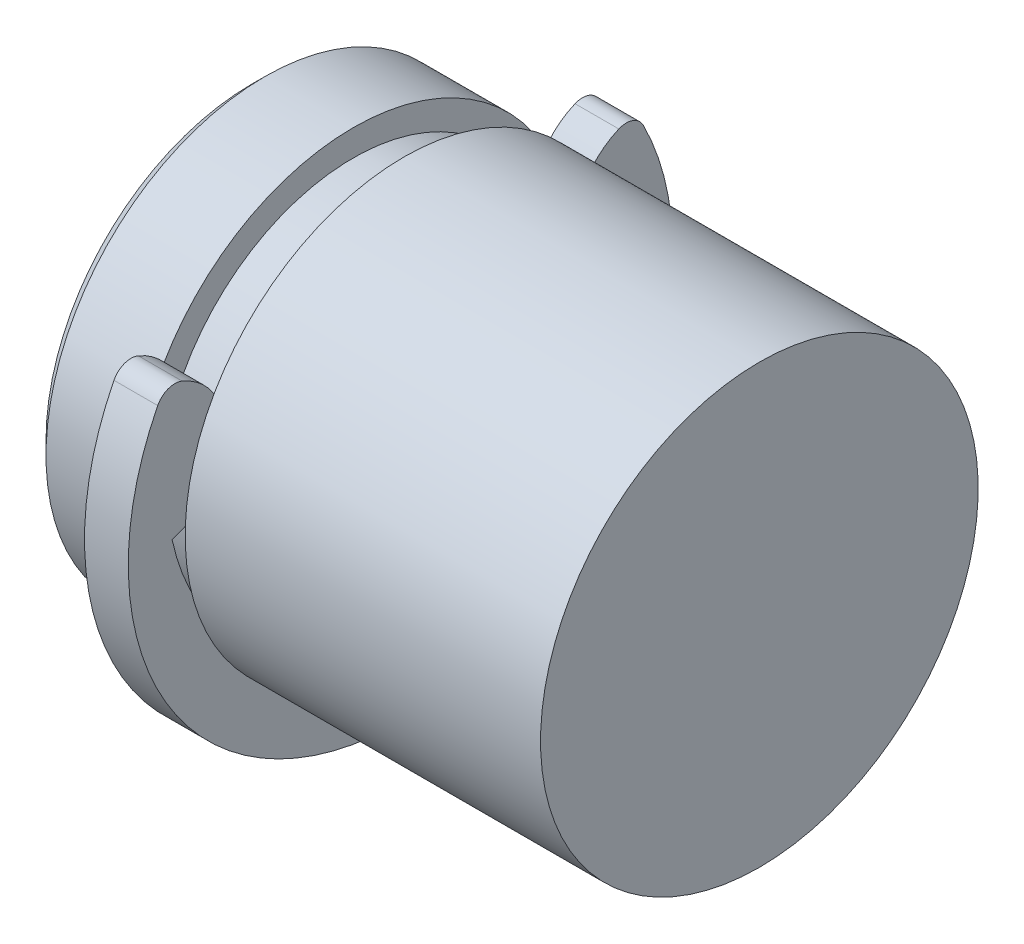
ISO-10303-21;
HEADER;
FILE_DESCRIPTION(('STEP AP214'),'2;1');
FILE_NAME('part.step','',(''),(''),'','','');
FILE_SCHEMA(('AUTOMOTIVE_DESIGN { 1 0 10303 214 1 1 1 1 }'));
ENDSEC;
DATA;
#1=APPLICATION_CONTEXT('core data for automotive mechanical design processes');
#2=APPLICATION_PROTOCOL_DEFINITION('international standard','automotive_design',2000,#1);
#3=PRODUCT_CONTEXT('',#1,'mechanical');
#4=PRODUCT('Part','Part','',(#3));
#5=PRODUCT_RELATED_PRODUCT_CATEGORY('part','',(#4));
#6=PRODUCT_DEFINITION_FORMATION('','',#4);
#7=PRODUCT_DEFINITION_CONTEXT('part definition',#1,'design');
#8=PRODUCT_DEFINITION('design','',#6,#7);
#9=PRODUCT_DEFINITION_SHAPE('','',#8);
#10=(LENGTH_UNIT() NAMED_UNIT(*) SI_UNIT(.MILLI.,.METRE.));
#11=(NAMED_UNIT(*) PLANE_ANGLE_UNIT() SI_UNIT($,.RADIAN.));
#12=(NAMED_UNIT(*) SI_UNIT($,.STERADIAN.) SOLID_ANGLE_UNIT());
#13=UNCERTAINTY_MEASURE_WITH_UNIT(LENGTH_MEASURE(1.E-05),#10,'distance_accuracy_value','');
#14=(GEOMETRIC_REPRESENTATION_CONTEXT(3) GLOBAL_UNCERTAINTY_ASSIGNED_CONTEXT((#13)) GLOBAL_UNIT_ASSIGNED_CONTEXT((#10,
#11,#12)) REPRESENTATION_CONTEXT('',''));
#15=CARTESIAN_POINT('',(0.,0.,0.));
#16=DIRECTION('',(0.,0.,1.));
#17=DIRECTION('',(1.,0.,0.));
#18=AXIS2_PLACEMENT_3D('',#15,#16,#17);
#19=CARTESIAN_POINT('',(-1.8415,-2.9845,0.));
#20=DIRECTION('',(-1.,0.,0.));
#21=DIRECTION('',(0.,-1.,0.));
#22=AXIS2_PLACEMENT_3D('',#19,#20,#21);
#23=PLANE('',#22);
#24=CARTESIAN_POINT('',(-1.84150000001182,0.,0.));
#25=DIRECTION('',(1.,0.,0.));
#26=DIRECTION('',(0.,1.,0.));
#27=AXIS2_PLACEMENT_3D('',#24,#25,#26);
#28=CIRCLE('',#27,2.98450000002504);
#29=CARTESIAN_POINT('',(-1.84150000001182,2.98450000002504,0.));
#30=VERTEX_POINT('',#29);
#31=EDGE_CURVE('P0_E18',#30,#30,#28,.T.);
#32=ORIENTED_EDGE('',*,*,#31,.F.);
#33=EDGE_LOOP('',(#32));
#34=FACE_BOUND('',#33,.T.);
#35=ADVANCED_FACE('P0_F15',(#34),#23,.T.);
#36=CARTESIAN_POINT('',(-1.65100000003804,0.,0.));
#37=DIRECTION('',(1.,0.,0.));
#38=DIRECTION('',(0.,1.,0.));
#39=AXIS2_PLACEMENT_3D('',#36,#37,#38);
#40=CONICAL_SURFACE('',#39,3.17499999999882,0.785398163397449);
#41=ORIENTED_EDGE('',*,*,#31,.T.);
#42=EDGE_LOOP('',(#41));
#43=FACE_BOUND('',#42,.T.);
#44=CARTESIAN_POINT('',(-1.651,0.,0.));
#45=DIRECTION('',(-1.,0.,0.));
#46=DIRECTION('',(0.,-1.,0.));
#47=AXIS2_PLACEMENT_3D('',#44,#45,#46);
#48=CIRCLE('',#47,3.175);
#49=CARTESIAN_POINT('',(-1.651,-3.175,0.));
#50=VERTEX_POINT('',#49);
#51=EDGE_CURVE('P0_E30',#50,#50,#48,.F.);
#52=ORIENTED_EDGE('',*,*,#51,.F.);
#53=EDGE_LOOP('',(#52));
#54=FACE_BOUND('',#53,.T.);
#55=ADVANCED_FACE('P0_F46',(#43,#54),#40,.T.);
#56=CARTESIAN_POINT('',(5.5245,0.,0.));
#57=DIRECTION('',(-1.,0.,0.));
#58=DIRECTION('',(0.,-1.,0.));
#59=AXIS2_PLACEMENT_3D('',#56,#57,#58);
#60=CYLINDRICAL_SURFACE('',#59,3.175);
#61=CARTESIAN_POINT('',(-0.3683,0.,0.));
#62=DIRECTION('',(-1.,0.,0.));
#63=DIRECTION('',(0.,-1.,0.));
#64=AXIS2_PLACEMENT_3D('',#61,#62,#63);
#65=CIRCLE('',#64,3.175);
#66=CARTESIAN_POINT('',(-0.3683,-3.175,0.));
#67=VERTEX_POINT('',#66);
#68=EDGE_CURVE('P0_E36',#67,#67,#65,.F.);
#69=ORIENTED_EDGE('',*,*,#68,.F.);
#70=EDGE_LOOP('',(#69));
#71=FACE_BOUND('',#70,.T.);
#72=ORIENTED_EDGE('',*,*,#51,.T.);
#73=EDGE_LOOP('',(#72));
#74=FACE_BOUND('',#73,.T.);
#75=ADVANCED_FACE('P0_F54',(#71,#74),#60,.T.);
#76=CARTESIAN_POINT('',(-0.3683,-2.794,0.));
#77=DIRECTION('',(1.,0.,0.));
#78=DIRECTION('',(0.,1.,0.));
#79=AXIS2_PLACEMENT_3D('',#76,#77,#78);
#80=PLANE('',#79);
#81=ORIENTED_EDGE('',*,*,#68,.T.);
#82=EDGE_LOOP('',(#81));
#83=FACE_BOUND('',#82,.T.);
#84=CARTESIAN_POINT('',(-0.3683,0.,0.));
#85=DIRECTION('',(-1.,0.,0.));
#86=DIRECTION('',(0.,-1.,0.));
#87=AXIS2_PLACEMENT_3D('',#84,#85,#86);
#88=CIRCLE('',#87,2.794);
#89=CARTESIAN_POINT('',(-0.3683,-2.794,0.));
#90=VERTEX_POINT('',#89);
#91=EDGE_CURVE('P0_E34',#90,#90,#88,.F.);
#92=ORIENTED_EDGE('',*,*,#91,.F.);
#93=EDGE_LOOP('',(#92));
#94=FACE_BOUND('',#93,.T.);
#95=ADVANCED_FACE('P0_F73',(#83,#94),#80,.T.);
#96=CARTESIAN_POINT('',(5.5245,0.,0.));
#97=DIRECTION('',(-1.,0.,0.));
#98=DIRECTION('',(0.,-1.,0.));
#99=AXIS2_PLACEMENT_3D('',#96,#97,#98);
#100=CYLINDRICAL_SURFACE('',#99,2.794);
#101=CARTESIAN_POINT('',(0.368299999999999,0.,0.));
#102=DIRECTION('',(-1.,0.,0.));
#103=DIRECTION('',(0.,-1.,0.));
#104=AXIS2_PLACEMENT_3D('',#101,#102,#103);
#105=CIRCLE('',#104,2.794);
#106=CARTESIAN_POINT('',(0.368299999999999,-2.794,0.));
#107=VERTEX_POINT('',#106);
#108=EDGE_CURVE('P0_E27',#107,#107,#105,.F.);
#109=ORIENTED_EDGE('',*,*,#108,.F.);
#110=EDGE_LOOP('',(#109));
#111=FACE_BOUND('',#110,.T.);
#112=ORIENTED_EDGE('',*,*,#91,.T.);
#113=EDGE_LOOP('',(#112));
#114=FACE_BOUND('',#113,.T.);
#115=ADVANCED_FACE('P0_F69',(#111,#114),#100,.T.);
#116=CARTESIAN_POINT('',(5.5245,0.,0.));
#117=DIRECTION('',(1.,0.,0.));
#118=DIRECTION('',(0.,1.,0.));
#119=AXIS2_PLACEMENT_3D('',#116,#117,#118);
#120=PLANE('',#119);
#121=CARTESIAN_POINT('',(5.5245,0.,0.));
#122=DIRECTION('',(-1.,0.,0.));
#123=DIRECTION('',(0.,-1.,0.));
#124=AXIS2_PLACEMENT_3D('',#121,#122,#123);
#125=CIRCLE('',#124,3.175);
#126=CARTESIAN_POINT('',(5.5245,-3.175,0.));
#127=VERTEX_POINT('',#126);
#128=EDGE_CURVE('P0_E22',#127,#127,#125,.T.);
#129=ORIENTED_EDGE('',*,*,#128,.F.);
#130=EDGE_LOOP('',(#129));
#131=FACE_BOUND('',#130,.T.);
#132=ADVANCED_FACE('P0_F62',(#131),#120,.T.);
#133=CARTESIAN_POINT('',(0.3683,-3.175,0.));
#134=DIRECTION('',(-1.,0.,0.));
#135=DIRECTION('',(0.,-1.,0.));
#136=AXIS2_PLACEMENT_3D('',#133,#134,#135);
#137=PLANE('',#136);
#138=ORIENTED_EDGE('',*,*,#108,.T.);
#139=EDGE_LOOP('',(#138));
#140=FACE_BOUND('',#139,.T.);
#141=CARTESIAN_POINT('',(0.368299999999999,0.,0.));
#142=DIRECTION('',(-1.,0.,0.));
#143=DIRECTION('',(0.,-1.,0.));
#144=AXIS2_PLACEMENT_3D('',#141,#142,#143);
#145=CIRCLE('',#144,3.175);
#146=CARTESIAN_POINT('',(0.368299999999999,-3.175,0.));
#147=VERTEX_POINT('',#146);
#148=EDGE_CURVE('P0_E10',#147,#147,#145,.F.);
#149=ORIENTED_EDGE('',*,*,#148,.F.);
#150=EDGE_LOOP('',(#149));
#151=FACE_BOUND('',#150,.T.);
#152=ADVANCED_FACE('P0_F57',(#140,#151),#137,.T.);
#153=CARTESIAN_POINT('',(5.5245,0.,0.));
#154=DIRECTION('',(-1.,0.,0.));
#155=DIRECTION('',(0.,-1.,0.));
#156=AXIS2_PLACEMENT_3D('',#153,#154,#155);
#157=CYLINDRICAL_SURFACE('',#156,3.175);
#158=ORIENTED_EDGE('',*,*,#148,.T.);
#159=EDGE_LOOP('',(#158));
#160=FACE_BOUND('',#159,.T.);
#161=ORIENTED_EDGE('',*,*,#128,.T.);
#162=EDGE_LOOP('',(#161));
#163=FACE_BOUND('',#162,.T.);
#164=ADVANCED_FACE('P0_F55',(#160,#163),#157,.T.);
#165=CLOSED_SHELL('',(#35,#55,#75,#95,#115,#132,#152,#164));
#166=MANIFOLD_SOLID_BREP('P0_B1',#165);
#167=CARTESIAN_POINT('',(-0.3175,0.846512328023186,1.77963484465552));
#168=DIRECTION('',(-1.,0.,0.));
#169=DIRECTION('',(0.,0.,1.));
#170=AXIS2_PLACEMENT_3D('',#167,#168,#169);
#171=PLANE('',#170);
#172=CARTESIAN_POINT('',(-0.3175,0.,0.));
#173=DIRECTION('',(-1.,0.,0.));
#174=DIRECTION('',(0.,0.,1.));
#175=AXIS2_PLACEMENT_3D('',#172,#173,#174);
#176=CIRCLE('',#175,3.9497);
#177=CARTESIAN_POINT('',(-0.3175,1.78646666666667,3.52259377999918));
#178=VERTEX_POINT('',#177);
#179=CARTESIAN_POINT('',(-0.3175,1.78646666666667,-3.52259377999918));
#180=VERTEX_POINT('',#179);
#181=EDGE_CURVE('P1_E91',#178,#180,#176,.F.);
#182=ORIENTED_EDGE('',*,*,#181,.F.);
#183=CARTESIAN_POINT('',(-0.3175,1.66096845654136,3.27513368312914));
#184=DIRECTION('',(-1.,0.,0.));
#185=DIRECTION('',(0.,0.,1.));
#186=AXIS2_PLACEMENT_3D('',#183,#184,#185);
#187=CIRCLE('',#186,0.277464052243861);
#188=CARTESIAN_POINT('',(-0.3175,1.91687954310492,3.16791513967025));
#189=VERTEX_POINT('',#188);
#190=EDGE_CURVE('P1_E81',#189,#178,#187,.F.);
#191=ORIENTED_EDGE('',*,*,#190,.F.);
#192=CARTESIAN_POINT('',(-0.3175,0.982787689221727,3.55926968931105));
#193=DIRECTION('',(-1.,0.,0.));
#194=DIRECTION('',(0.,0.,1.));
#195=AXIS2_PLACEMENT_3D('',#192,#193,#194);
#196=CIRCLE('',#195,1.01276155881603);
#197=CARTESIAN_POINT('',(-0.3175,0.,3.3147));
#198=VERTEX_POINT('',#197);
#199=EDGE_CURVE('P1_E76',#198,#189,#196,.F.);
#200=ORIENTED_EDGE('',*,*,#199,.F.);
#201=CARTESIAN_POINT('',(-0.3175,0.710236966824645,0.));
#202=DIRECTION('',(-1.,0.,0.));
#203=DIRECTION('',(0.,0.,1.));
#204=AXIS2_PLACEMENT_3D('',#201,#202,#203);
#205=CIRCLE('',#204,3.38993696682464);
#206=CARTESIAN_POINT('',(-0.3175,0.,-3.3147));
#207=VERTEX_POINT('',#206);
#208=EDGE_CURVE('P1_E20',#198,#207,#205,.F.);
#209=ORIENTED_EDGE('',*,*,#208,.T.);
#210=CARTESIAN_POINT('',(-0.3175,0.982787689221727,-3.55926968931105));
#211=DIRECTION('',(-1.,0.,0.));
#212=DIRECTION('',(0.,0.,1.));
#213=AXIS2_PLACEMENT_3D('',#210,#211,#212);
#214=CIRCLE('',#213,1.01276155881603);
#215=CARTESIAN_POINT('',(-0.3175,1.91687954310492,-3.16791513967025));
#216=VERTEX_POINT('',#215);
#217=EDGE_CURVE('P1_E96',#216,#207,#214,.F.);
#218=ORIENTED_EDGE('',*,*,#217,.F.);
#219=CARTESIAN_POINT('',(-0.3175,1.66096845654136,-3.27513368312914));
#220=DIRECTION('',(-1.,0.,0.));
#221=DIRECTION('',(0.,0.,1.));
#222=AXIS2_PLACEMENT_3D('',#219,#220,#221);
#223=CIRCLE('',#222,0.277464052243861);
#224=EDGE_CURVE('P1_E94',#180,#216,#223,.F.);
#225=ORIENTED_EDGE('',*,*,#224,.F.);
#226=EDGE_LOOP('',(#182,#191,#200,#209,#218,#225));
#227=FACE_BOUND('',#226,.T.);
#228=ADVANCED_FACE('P1_F17',(#227),#171,.T.);
#229=CARTESIAN_POINT('',(0.3175,0.710236966824645,0.));
#230=DIRECTION('',(-1.,0.,0.));
#231=DIRECTION('',(0.,0.,1.));
#232=AXIS2_PLACEMENT_3D('',#229,#230,#231);
#233=CYLINDRICAL_SURFACE('',#232,3.38993696682464);
#234=DIRECTION('',(-1.,0.,0.));
#235=VECTOR('',#234,1.);
#236=CARTESIAN_POINT('',(0.3175,0.,3.3147));
#237=LINE('',#236,#235);
#238=CARTESIAN_POINT('',(0.3175,0.,3.3147));
#239=VERTEX_POINT('',#238);
#240=EDGE_CURVE('P1_E70',#239,#198,#237,.T.);
#241=ORIENTED_EDGE('',*,*,#240,.F.);
#242=CARTESIAN_POINT('',(0.3175,0.710236966824645,0.));
#243=DIRECTION('',(-1.,0.,0.));
#244=DIRECTION('',(0.,0.,1.));
#245=AXIS2_PLACEMENT_3D('',#242,#243,#244);
#246=CIRCLE('',#245,3.38993696682464);
#247=CARTESIAN_POINT('',(0.3175,0.,-3.3147));
#248=VERTEX_POINT('',#247);
#249=EDGE_CURVE('P1_E78',#239,#248,#246,.F.);
#250=ORIENTED_EDGE('',*,*,#249,.T.);
#251=DIRECTION('',(-1.,0.,0.));
#252=VECTOR('',#251,1.);
#253=CARTESIAN_POINT('',(0.3175,0.,-3.3147));
#254=LINE('',#253,#252);
#255=EDGE_CURVE('P1_E71',#207,#248,#254,.F.);
#256=ORIENTED_EDGE('',*,*,#255,.F.);
#257=ORIENTED_EDGE('',*,*,#208,.F.);
#258=EDGE_LOOP('',(#241,#250,#256,#257));
#259=FACE_BOUND('',#258,.T.);
#260=ADVANCED_FACE('P1_F68',(#259),#233,.F.);
#261=CARTESIAN_POINT('',(0.3175,0.982787689221727,-3.55926968931105));
#262=DIRECTION('',(-1.,0.,0.));
#263=DIRECTION('',(0.,0.,1.));
#264=AXIS2_PLACEMENT_3D('',#261,#262,#263);
#265=CYLINDRICAL_SURFACE('',#264,1.01276155881603);
#266=DIRECTION('',(-1.,0.,0.));
#267=VECTOR('',#266,1.);
#268=CARTESIAN_POINT('',(0.3175,1.91687954310492,-3.16791513967025));
#269=LINE('',#268,#267);
#270=CARTESIAN_POINT('',(0.3175,1.91687954310492,-3.16791513967025));
#271=VERTEX_POINT('',#270);
#272=EDGE_CURVE('P1_E95',#216,#271,#269,.F.);
#273=ORIENTED_EDGE('',*,*,#272,.F.);
#274=ORIENTED_EDGE('',*,*,#217,.T.);
#275=ORIENTED_EDGE('',*,*,#255,.T.);
#276=CARTESIAN_POINT('',(0.3175,0.982787689221727,-3.55926968931105));
#277=DIRECTION('',(-1.,0.,0.));
#278=DIRECTION('',(0.,0.,1.));
#279=AXIS2_PLACEMENT_3D('',#276,#277,#278);
#280=CIRCLE('',#279,1.01276155881603);
#281=EDGE_CURVE('P1_E111',#248,#271,#280,.T.);
#282=ORIENTED_EDGE('',*,*,#281,.T.);
#283=EDGE_LOOP('',(#273,#274,#275,#282));
#284=FACE_BOUND('',#283,.T.);
#285=ADVANCED_FACE('P1_F168',(#284),#265,.T.);
#286=CARTESIAN_POINT('',(0.3175,1.66096845654136,-3.27513368312914));
#287=DIRECTION('',(-1.,0.,0.));
#288=DIRECTION('',(0.,0.,1.));
#289=AXIS2_PLACEMENT_3D('',#286,#287,#288);
#290=CYLINDRICAL_SURFACE('',#289,0.277464052243861);
#291=CARTESIAN_POINT('',(0.3175,1.66096845654136,-3.27513368312914));
#292=DIRECTION('',(-1.,0.,0.));
#293=DIRECTION('',(0.,0.,1.));
#294=AXIS2_PLACEMENT_3D('',#291,#292,#293);
#295=CIRCLE('',#294,0.277464052243861);
#296=CARTESIAN_POINT('',(0.3175,1.78646666666667,-3.52259377999918));
#297=VERTEX_POINT('',#296);
#298=EDGE_CURVE('P1_E109',#271,#297,#295,.T.);
#299=ORIENTED_EDGE('',*,*,#298,.T.);
#300=DIRECTION('',(-1.,0.,0.));
#301=VECTOR('',#300,1.);
#302=CARTESIAN_POINT('',(0.3175,1.78646666666667,-3.52259377999918));
#303=LINE('',#302,#301);
#304=EDGE_CURVE('P1_E93',#180,#297,#303,.F.);
#305=ORIENTED_EDGE('',*,*,#304,.F.);
#306=ORIENTED_EDGE('',*,*,#224,.T.);
#307=ORIENTED_EDGE('',*,*,#272,.T.);
#308=EDGE_LOOP('',(#299,#305,#306,#307));
#309=FACE_BOUND('',#308,.T.);
#310=ADVANCED_FACE('P1_F120',(#309),#290,.T.);
#311=CARTESIAN_POINT('',(0.3175,0.,0.));
#312=DIRECTION('',(-1.,0.,0.));
#313=DIRECTION('',(0.,0.,1.));
#314=AXIS2_PLACEMENT_3D('',#311,#312,#313);
#315=CYLINDRICAL_SURFACE('',#314,3.9497);
#316=DIRECTION('',(-1.,0.,0.));
#317=VECTOR('',#316,1.);
#318=CARTESIAN_POINT('',(0.3175,1.78646666666667,3.52259377999918));
#319=LINE('',#318,#317);
#320=CARTESIAN_POINT('',(0.3175,1.78646666666667,3.52259377999918));
#321=VERTEX_POINT('',#320);
#322=EDGE_CURVE('P1_E82',#178,#321,#319,.F.);
#323=ORIENTED_EDGE('',*,*,#322,.F.);
#324=ORIENTED_EDGE('',*,*,#181,.T.);
#325=ORIENTED_EDGE('',*,*,#304,.T.);
#326=CARTESIAN_POINT('',(0.3175,0.,0.));
#327=DIRECTION('',(-1.,0.,0.));
#328=DIRECTION('',(0.,0.,1.));
#329=AXIS2_PLACEMENT_3D('',#326,#327,#328);
#330=CIRCLE('',#329,3.9497);
#331=EDGE_CURVE('P1_E107',#297,#321,#330,.T.);
#332=ORIENTED_EDGE('',*,*,#331,.T.);
#333=EDGE_LOOP('',(#323,#324,#325,#332));
#334=FACE_BOUND('',#333,.T.);
#335=ADVANCED_FACE('P1_F124',(#334),#315,.T.);
#336=CARTESIAN_POINT('',(0.3175,1.66096845654136,3.27513368312914));
#337=DIRECTION('',(-1.,0.,0.));
#338=DIRECTION('',(0.,0.,1.));
#339=AXIS2_PLACEMENT_3D('',#336,#337,#338);
#340=CYLINDRICAL_SURFACE('',#339,0.277464052243861);
#341=CARTESIAN_POINT('',(0.3175,1.66096845654136,3.27513368312914));
#342=DIRECTION('',(-1.,0.,0.));
#343=DIRECTION('',(0.,0.,1.));
#344=AXIS2_PLACEMENT_3D('',#341,#342,#343);
#345=CIRCLE('',#344,0.277464052243861);
#346=CARTESIAN_POINT('',(0.3175,1.91687954310492,3.16791513967025));
#347=VERTEX_POINT('',#346);
#348=EDGE_CURVE('P1_E26',#321,#347,#345,.T.);
#349=ORIENTED_EDGE('',*,*,#348,.T.);
#350=DIRECTION('',(-1.,0.,0.));
#351=VECTOR('',#350,1.);
#352=CARTESIAN_POINT('',(0.3175,1.91687954310492,3.16791513967025));
#353=LINE('',#352,#351);
#354=EDGE_CURVE('P1_E34',#189,#347,#353,.F.);
#355=ORIENTED_EDGE('',*,*,#354,.F.);
#356=ORIENTED_EDGE('',*,*,#190,.T.);
#357=ORIENTED_EDGE('',*,*,#322,.T.);
#358=EDGE_LOOP('',(#349,#355,#356,#357));
#359=FACE_BOUND('',#358,.T.);
#360=ADVANCED_FACE('P1_F126',(#359),#340,.T.);
#361=CARTESIAN_POINT('',(0.3175,0.982787689221727,3.55926968931105));
#362=DIRECTION('',(-1.,0.,0.));
#363=DIRECTION('',(0.,0.,1.));
#364=AXIS2_PLACEMENT_3D('',#361,#362,#363);
#365=CYLINDRICAL_SURFACE('',#364,1.01276155881603);
#366=CARTESIAN_POINT('',(0.3175,0.982787689221727,3.55926968931105));
#367=DIRECTION('',(-1.,0.,0.));
#368=DIRECTION('',(0.,0.,1.));
#369=AXIS2_PLACEMENT_3D('',#366,#367,#368);
#370=CIRCLE('',#369,1.01276155881603);
#371=EDGE_CURVE('P1_E11',#347,#239,#370,.T.);
#372=ORIENTED_EDGE('',*,*,#371,.T.);
#373=ORIENTED_EDGE('',*,*,#240,.T.);
#374=ORIENTED_EDGE('',*,*,#199,.T.);
#375=ORIENTED_EDGE('',*,*,#354,.T.);
#376=EDGE_LOOP('',(#372,#373,#374,#375));
#377=FACE_BOUND('',#376,.T.);
#378=ADVANCED_FACE('P1_F75',(#377),#365,.T.);
#379=CARTESIAN_POINT('',(0.3175,0.846512328023186,1.77963484465552));
#380=DIRECTION('',(-1.,0.,0.));
#381=DIRECTION('',(0.,0.,1.));
#382=AXIS2_PLACEMENT_3D('',#379,#380,#381);
#383=PLANE('',#382);
#384=ORIENTED_EDGE('',*,*,#348,.F.);
#385=ORIENTED_EDGE('',*,*,#331,.F.);
#386=ORIENTED_EDGE('',*,*,#298,.F.);
#387=ORIENTED_EDGE('',*,*,#281,.F.);
#388=ORIENTED_EDGE('',*,*,#249,.F.);
#389=ORIENTED_EDGE('',*,*,#371,.F.);
#390=EDGE_LOOP('',(#384,#385,#386,#387,#388,#389));
#391=FACE_BOUND('',#390,.T.);
#392=ADVANCED_FACE('P1_F115',(#391),#383,.F.);
#393=CLOSED_SHELL('',(#228,#260,#285,#310,#335,#360,#378,#392));
#394=MANIFOLD_SOLID_BREP('P1_B1',#393);
#395=ADVANCED_BREP_SHAPE_REPRESENTATION('',(#18,#166,#394),#14);
#396=SHAPE_DEFINITION_REPRESENTATION(#9,#395);
ENDSEC;
END-ISO-10303-21;
